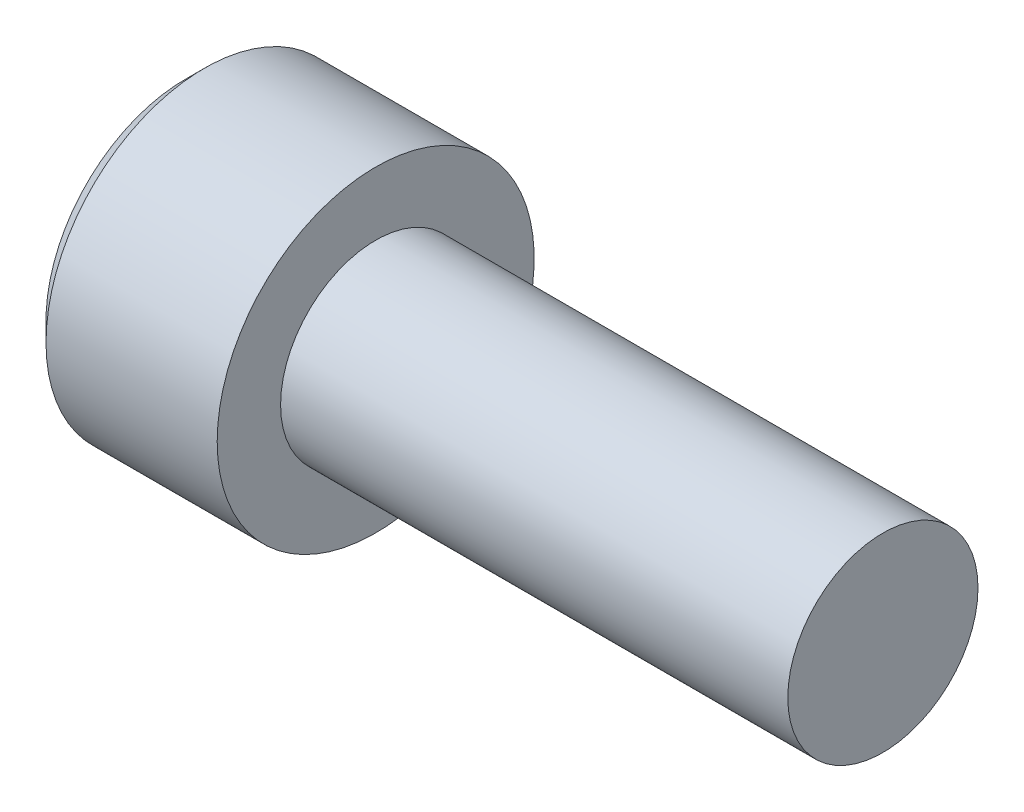
ISO-10303-21;
HEADER;
FILE_DESCRIPTION(('STEP AP214'),'2;1');
FILE_NAME('part.step','',(''),(''),'','','');
FILE_SCHEMA(('AUTOMOTIVE_DESIGN { 1 0 10303 214 1 1 1 1 }'));
ENDSEC;
DATA;
#1=APPLICATION_CONTEXT('core data for automotive mechanical design processes');
#2=APPLICATION_PROTOCOL_DEFINITION('international standard','automotive_design',2000,#1);
#3=PRODUCT_CONTEXT('',#1,'mechanical');
#4=PRODUCT('Part','Part','',(#3));
#5=PRODUCT_RELATED_PRODUCT_CATEGORY('part','',(#4));
#6=PRODUCT_DEFINITION_FORMATION('','',#4);
#7=PRODUCT_DEFINITION_CONTEXT('part definition',#1,'design');
#8=PRODUCT_DEFINITION('design','',#6,#7);
#9=PRODUCT_DEFINITION_SHAPE('','',#8);
#10=(LENGTH_UNIT() NAMED_UNIT(*) SI_UNIT(.MILLI.,.METRE.));
#11=(NAMED_UNIT(*) PLANE_ANGLE_UNIT() SI_UNIT($,.RADIAN.));
#12=(NAMED_UNIT(*) SI_UNIT($,.STERADIAN.) SOLID_ANGLE_UNIT());
#13=UNCERTAINTY_MEASURE_WITH_UNIT(LENGTH_MEASURE(1.E-05),#10,'distance_accuracy_value','');
#14=(GEOMETRIC_REPRESENTATION_CONTEXT(3) GLOBAL_UNCERTAINTY_ASSIGNED_CONTEXT((#13)) GLOBAL_UNIT_ASSIGNED_CONTEXT((#10,
#11,#12)) REPRESENTATION_CONTEXT('',''));
#15=CARTESIAN_POINT('',(0.,0.,0.));
#16=DIRECTION('',(0.,0.,1.));
#17=DIRECTION('',(1.,0.,0.));
#18=AXIS2_PLACEMENT_3D('',#15,#16,#17);
#19=CARTESIAN_POINT('',(-6.,0.,0.));
#20=DIRECTION('',(1.,0.,0.));
#21=DIRECTION('',(0.,0.,-1.));
#22=AXIS2_PLACEMENT_3D('',#19,#20,#21);
#23=PLANE('',#22);
#24=CARTESIAN_POINT('',(-6.,0.,0.));
#25=DIRECTION('',(1.,0.,0.));
#26=DIRECTION('',(0.,0.,-1.));
#27=AXIS2_PLACEMENT_3D('',#24,#25,#26);
#28=CIRCLE('',#27,4.4);
#29=CARTESIAN_POINT('',(-6.,0.,-4.4));
#30=VERTEX_POINT('',#29);
#31=EDGE_CURVE('E45',#30,#30,#28,.F.);
#32=ORIENTED_EDGE('',*,*,#31,.T.);
#33=EDGE_LOOP('',(#32));
#34=FACE_BOUND('',#33,.T.);
#35=DIRECTION('',(0.,0.5,-0.866025403784439));
#36=VECTOR('',#35,1.);
#37=CARTESIAN_POINT('',(-6.,1.44337567297406,2.5));
#38=LINE('',#37,#36);
#39=CARTESIAN_POINT('',(-6.,1.44337567297406,2.5));
#40=VERTEX_POINT('',#39);
#41=CARTESIAN_POINT('',(-6.,2.88675134594813,0.));
#42=VERTEX_POINT('',#41);
#43=EDGE_CURVE('E150',#40,#42,#38,.T.);
#44=ORIENTED_EDGE('',*,*,#43,.F.);
#45=DIRECTION('',(0.,1.,0.));
#46=VECTOR('',#45,1.);
#47=CARTESIAN_POINT('',(-6.,-1.44337567297407,2.5));
#48=LINE('',#47,#46);
#49=CARTESIAN_POINT('',(-6.,-1.44337567297407,2.5));
#50=VERTEX_POINT('',#49);
#51=EDGE_CURVE('E123',#50,#40,#48,.T.);
#52=ORIENTED_EDGE('',*,*,#51,.F.);
#53=DIRECTION('',(0.,0.5,0.866025403784439));
#54=VECTOR('',#53,1.);
#55=CARTESIAN_POINT('',(-6.,-2.88675134594813,0.));
#56=LINE('',#55,#54);
#57=CARTESIAN_POINT('',(-6.,-2.88675134594813,0.));
#58=VERTEX_POINT('',#57);
#59=EDGE_CURVE('E119',#58,#50,#56,.T.);
#60=ORIENTED_EDGE('',*,*,#59,.F.);
#61=DIRECTION('',(0.,-0.5,0.866025403784438));
#62=VECTOR('',#61,1.);
#63=CARTESIAN_POINT('',(-6.,-1.44337567297407,-2.5));
#64=LINE('',#63,#62);
#65=CARTESIAN_POINT('',(-6.,-1.44337567297407,-2.5));
#66=VERTEX_POINT('',#65);
#67=EDGE_CURVE('E156',#66,#58,#64,.T.);
#68=ORIENTED_EDGE('',*,*,#67,.F.);
#69=DIRECTION('',(0.,-1.,0.));
#70=VECTOR('',#69,1.);
#71=CARTESIAN_POINT('',(-6.,1.44337567297406,-2.5));
#72=LINE('',#71,#70);
#73=CARTESIAN_POINT('',(-6.,1.44337567297406,-2.5));
#74=VERTEX_POINT('',#73);
#75=EDGE_CURVE('E154',#74,#66,#72,.T.);
#76=ORIENTED_EDGE('',*,*,#75,.F.);
#77=DIRECTION('',(0.,-0.5,-0.866025403784439));
#78=VECTOR('',#77,1.);
#79=CARTESIAN_POINT('',(-6.,2.88675134594813,0.));
#80=LINE('',#79,#78);
#81=EDGE_CURVE('E152',#42,#74,#80,.T.);
#82=ORIENTED_EDGE('',*,*,#81,.F.);
#83=EDGE_LOOP('',(#44,#52,#60,#68,#76,#82));
#84=FACE_BOUND('',#83,.T.);
#85=ADVANCED_FACE('F37',(#34,#84),#23,.F.);
#86=CARTESIAN_POINT('',(0.,3.,0.));
#87=DIRECTION('',(-1.,0.,0.));
#88=DIRECTION('',(0.,0.,1.));
#89=AXIS2_PLACEMENT_3D('',#86,#87,#88);
#90=PLANE('',#89);
#91=CARTESIAN_POINT('',(0.,0.,0.));
#92=DIRECTION('',(-1.,0.,0.));
#93=DIRECTION('',(0.,0.,1.));
#94=AXIS2_PLACEMENT_3D('',#91,#92,#93);
#95=CIRCLE('',#94,5.);
#96=CARTESIAN_POINT('',(0.,0.,5.));
#97=VERTEX_POINT('',#96);
#98=EDGE_CURVE('E182',#97,#97,#95,.T.);
#99=ORIENTED_EDGE('',*,*,#98,.F.);
#100=EDGE_LOOP('',(#99));
#101=FACE_BOUND('',#100,.T.);
#102=CARTESIAN_POINT('',(0.,0.,0.));
#103=DIRECTION('',(-1.,0.,0.));
#104=DIRECTION('',(0.,0.,1.));
#105=AXIS2_PLACEMENT_3D('',#102,#103,#104);
#106=CIRCLE('',#105,3.);
#107=CARTESIAN_POINT('',(0.,0.,3.));
#108=VERTEX_POINT('',#107);
#109=EDGE_CURVE('E176',#108,#108,#106,.T.);
#110=ORIENTED_EDGE('',*,*,#109,.T.);
#111=EDGE_LOOP('',(#110));
#112=FACE_BOUND('',#111,.T.);
#113=ADVANCED_FACE('F200',(#101,#112),#90,.F.);
#114=CARTESIAN_POINT('',(-6.,0.,0.));
#115=DIRECTION('',(-1.,0.,0.));
#116=DIRECTION('',(0.,0.,1.));
#117=AXIS2_PLACEMENT_3D('',#114,#115,#116);
#118=CYLINDRICAL_SURFACE('',#117,5.);
#119=CARTESIAN_POINT('',(-5.4,0.,0.));
#120=DIRECTION('',(1.,0.,0.));
#121=DIRECTION('',(0.,0.,-1.));
#122=AXIS2_PLACEMENT_3D('',#119,#120,#121);
#123=CIRCLE('',#122,5.);
#124=CARTESIAN_POINT('',(-5.4,0.,-5.));
#125=VERTEX_POINT('',#124);
#126=EDGE_CURVE('E11',#125,#125,#123,.T.);
#127=ORIENTED_EDGE('',*,*,#126,.T.);
#128=EDGE_LOOP('',(#127));
#129=FACE_BOUND('',#128,.T.);
#130=ORIENTED_EDGE('',*,*,#98,.T.);
#131=EDGE_LOOP('',(#130));
#132=FACE_BOUND('',#131,.T.);
#133=ADVANCED_FACE('F205',(#129,#132),#118,.T.);
#134=CARTESIAN_POINT('',(16.,3.,0.));
#135=DIRECTION('',(-1.,0.,0.));
#136=DIRECTION('',(0.,0.,1.));
#137=AXIS2_PLACEMENT_3D('',#134,#135,#136);
#138=PLANE('',#137);
#139=CARTESIAN_POINT('',(16.,0.,0.));
#140=DIRECTION('',(-1.,0.,0.));
#141=DIRECTION('',(0.,0.,1.));
#142=AXIS2_PLACEMENT_3D('',#139,#140,#141);
#143=CIRCLE('',#142,3.);
#144=CARTESIAN_POINT('',(16.,0.,3.));
#145=VERTEX_POINT('',#144);
#146=EDGE_CURVE('E179',#145,#145,#143,.T.);
#147=ORIENTED_EDGE('',*,*,#146,.F.);
#148=EDGE_LOOP('',(#147));
#149=FACE_BOUND('',#148,.T.);
#150=ADVANCED_FACE('F209',(#149),#138,.F.);
#151=CARTESIAN_POINT('',(-6.,0.,0.));
#152=DIRECTION('',(-1.,0.,0.));
#153=DIRECTION('',(0.,0.,1.));
#154=AXIS2_PLACEMENT_3D('',#151,#152,#153);
#155=CYLINDRICAL_SURFACE('',#154,3.);
#156=ORIENTED_EDGE('',*,*,#109,.F.);
#157=EDGE_LOOP('',(#156));
#158=FACE_BOUND('',#157,.T.);
#159=ORIENTED_EDGE('',*,*,#146,.T.);
#160=EDGE_LOOP('',(#159));
#161=FACE_BOUND('',#160,.T.);
#162=ADVANCED_FACE('F216',(#158,#161),#155,.T.);
#163=CARTESIAN_POINT('',(-3.,-1.44337567297407,2.5));
#164=DIRECTION('',(0.,0.,1.));
#165=DIRECTION('',(1.,0.,0.));
#166=AXIS2_PLACEMENT_3D('',#163,#164,#165);
#167=PLANE('',#166);
#168=DIRECTION('',(0.,1.,0.));
#169=VECTOR('',#168,1.);
#170=CARTESIAN_POINT('',(-3.,-1.44337567297407,2.5));
#171=LINE('',#170,#169);
#172=CARTESIAN_POINT('',(-3.,-1.44337567297407,2.5));
#173=VERTEX_POINT('',#172);
#174=CARTESIAN_POINT('',(-3.,0.,2.5));
#175=VERTEX_POINT('',#174);
#176=EDGE_CURVE('E60',#173,#175,#171,.T.);
#177=ORIENTED_EDGE('',*,*,#176,.F.);
#178=DIRECTION('',(-1.,0.,0.));
#179=VECTOR('',#178,1.);
#180=CARTESIAN_POINT('',(-3.,-1.44337567297407,2.5));
#181=LINE('',#180,#179);
#182=EDGE_CURVE('E160',#173,#50,#181,.T.);
#183=ORIENTED_EDGE('',*,*,#182,.T.);
#184=ORIENTED_EDGE('',*,*,#51,.T.);
#185=DIRECTION('',(-1.,0.,0.));
#186=VECTOR('',#185,1.);
#187=CARTESIAN_POINT('',(-3.,1.44337567297406,2.5));
#188=LINE('',#187,#186);
#189=CARTESIAN_POINT('',(-3.,1.44337567297406,2.5));
#190=VERTEX_POINT('',#189);
#191=EDGE_CURVE('E52',#190,#40,#188,.T.);
#192=ORIENTED_EDGE('',*,*,#191,.F.);
#193=EDGE_CURVE('E112',#175,#190,#171,.T.);
#194=ORIENTED_EDGE('',*,*,#193,.F.);
#195=EDGE_LOOP('',(#177,#183,#184,#192,#194));
#196=FACE_BOUND('',#195,.T.);
#197=ADVANCED_FACE('F121',(#196),#167,.F.);
#198=CARTESIAN_POINT('',(-3.,-2.88675134594813,0.));
#199=DIRECTION('',(0.,-0.866025403784439,0.5));
#200=DIRECTION('',(0.,-0.5,-0.866025403784439));
#201=AXIS2_PLACEMENT_3D('',#198,#199,#200);
#202=PLANE('',#201);
#203=DIRECTION('',(0.,0.5,0.866025403784439));
#204=VECTOR('',#203,1.);
#205=CARTESIAN_POINT('',(-3.,-2.88675134594813,0.));
#206=LINE('',#205,#204);
#207=CARTESIAN_POINT('',(-3.,-2.88675134594813,0.));
#208=VERTEX_POINT('',#207);
#209=CARTESIAN_POINT('',(-3.,-2.1650635094611,1.25));
#210=VERTEX_POINT('',#209);
#211=EDGE_CURVE('E126',#208,#210,#206,.T.);
#212=ORIENTED_EDGE('',*,*,#211,.F.);
#213=DIRECTION('',(-1.,0.,0.));
#214=VECTOR('',#213,1.);
#215=CARTESIAN_POINT('',(-3.,-2.88675134594813,0.));
#216=LINE('',#215,#214);
#217=EDGE_CURVE('E163',#208,#58,#216,.T.);
#218=ORIENTED_EDGE('',*,*,#217,.T.);
#219=ORIENTED_EDGE('',*,*,#59,.T.);
#220=ORIENTED_EDGE('',*,*,#182,.F.);
#221=EDGE_CURVE('E146',#210,#173,#206,.T.);
#222=ORIENTED_EDGE('',*,*,#221,.F.);
#223=EDGE_LOOP('',(#212,#218,#219,#220,#222));
#224=FACE_BOUND('',#223,.T.);
#225=ADVANCED_FACE('F229',(#224),#202,.F.);
#226=CARTESIAN_POINT('',(-3.,-1.44337567297407,-2.5));
#227=DIRECTION('',(0.,-0.866025403784439,-0.5));
#228=DIRECTION('',(0.,0.5,-0.866025403784439));
#229=AXIS2_PLACEMENT_3D('',#226,#227,#228);
#230=PLANE('',#229);
#231=DIRECTION('',(0.,-0.5,0.866025403784438));
#232=VECTOR('',#231,1.);
#233=CARTESIAN_POINT('',(-3.,-1.44337567297407,-2.5));
#234=LINE('',#233,#232);
#235=CARTESIAN_POINT('',(-3.,-1.44337567297407,-2.5));
#236=VERTEX_POINT('',#235);
#237=CARTESIAN_POINT('',(-3.,-2.1650635094611,-1.25));
#238=VERTEX_POINT('',#237);
#239=EDGE_CURVE('E143',#236,#238,#234,.T.);
#240=ORIENTED_EDGE('',*,*,#239,.F.);
#241=DIRECTION('',(-1.,0.,0.));
#242=VECTOR('',#241,1.);
#243=CARTESIAN_POINT('',(-3.,-1.44337567297407,-2.5));
#244=LINE('',#243,#242);
#245=EDGE_CURVE('E166',#236,#66,#244,.T.);
#246=ORIENTED_EDGE('',*,*,#245,.T.);
#247=ORIENTED_EDGE('',*,*,#67,.T.);
#248=ORIENTED_EDGE('',*,*,#217,.F.);
#249=EDGE_CURVE('E142',#238,#208,#234,.T.);
#250=ORIENTED_EDGE('',*,*,#249,.F.);
#251=EDGE_LOOP('',(#240,#246,#247,#248,#250));
#252=FACE_BOUND('',#251,.T.);
#253=ADVANCED_FACE('F241',(#252),#230,.F.);
#254=CARTESIAN_POINT('',(-3.,1.44337567297406,-2.5));
#255=DIRECTION('',(0.,0.,-1.));
#256=DIRECTION('',(0.,1.,0.));
#257=AXIS2_PLACEMENT_3D('',#254,#255,#256);
#258=PLANE('',#257);
#259=DIRECTION('',(0.,-1.,0.));
#260=VECTOR('',#259,1.);
#261=CARTESIAN_POINT('',(-3.,1.44337567297406,-2.5));
#262=LINE('',#261,#260);
#263=CARTESIAN_POINT('',(-3.,1.44337567297406,-2.5));
#264=VERTEX_POINT('',#263);
#265=CARTESIAN_POINT('',(-3.,0.,-2.5));
#266=VERTEX_POINT('',#265);
#267=EDGE_CURVE('E139',#264,#266,#262,.T.);
#268=ORIENTED_EDGE('',*,*,#267,.F.);
#269=DIRECTION('',(-1.,0.,0.));
#270=VECTOR('',#269,1.);
#271=CARTESIAN_POINT('',(-3.,1.44337567297406,-2.5));
#272=LINE('',#271,#270);
#273=EDGE_CURVE('E169',#264,#74,#272,.T.);
#274=ORIENTED_EDGE('',*,*,#273,.T.);
#275=ORIENTED_EDGE('',*,*,#75,.T.);
#276=ORIENTED_EDGE('',*,*,#245,.F.);
#277=EDGE_CURVE('E138',#266,#236,#262,.T.);
#278=ORIENTED_EDGE('',*,*,#277,.F.);
#279=EDGE_LOOP('',(#268,#274,#275,#276,#278));
#280=FACE_BOUND('',#279,.T.);
#281=ADVANCED_FACE('F237',(#280),#258,.F.);
#282=CARTESIAN_POINT('',(-3.,2.88675134594813,0.));
#283=DIRECTION('',(0.,0.866025403784439,-0.5));
#284=DIRECTION('',(0.,0.5,0.866025403784439));
#285=AXIS2_PLACEMENT_3D('',#282,#283,#284);
#286=PLANE('',#285);
#287=DIRECTION('',(0.,-0.5,-0.866025403784439));
#288=VECTOR('',#287,1.);
#289=CARTESIAN_POINT('',(-3.,2.88675134594813,0.));
#290=LINE('',#289,#288);
#291=CARTESIAN_POINT('',(-3.,2.88675134594813,0.));
#292=VERTEX_POINT('',#291);
#293=CARTESIAN_POINT('',(-3.,2.1650635094611,-1.25));
#294=VERTEX_POINT('',#293);
#295=EDGE_CURVE('E134',#292,#294,#290,.T.);
#296=ORIENTED_EDGE('',*,*,#295,.F.);
#297=DIRECTION('',(-1.,0.,0.));
#298=VECTOR('',#297,1.);
#299=CARTESIAN_POINT('',(-3.,2.88675134594813,0.));
#300=LINE('',#299,#298);
#301=EDGE_CURVE('E125',#292,#42,#300,.T.);
#302=ORIENTED_EDGE('',*,*,#301,.T.);
#303=ORIENTED_EDGE('',*,*,#81,.T.);
#304=ORIENTED_EDGE('',*,*,#273,.F.);
#305=EDGE_CURVE('E132',#294,#264,#290,.T.);
#306=ORIENTED_EDGE('',*,*,#305,.F.);
#307=EDGE_LOOP('',(#296,#302,#303,#304,#306));
#308=FACE_BOUND('',#307,.T.);
#309=ADVANCED_FACE('F234',(#308),#286,.F.);
#310=CARTESIAN_POINT('',(-3.,1.44337567297406,2.5));
#311=DIRECTION('',(0.,0.866025403784438,0.5));
#312=DIRECTION('',(0.,-0.5,0.866025403784439));
#313=AXIS2_PLACEMENT_3D('',#310,#311,#312);
#314=PLANE('',#313);
#315=DIRECTION('',(0.,0.5,-0.866025403784439));
#316=VECTOR('',#315,1.);
#317=CARTESIAN_POINT('',(-3.,1.44337567297406,2.5));
#318=LINE('',#317,#316);
#319=CARTESIAN_POINT('',(-3.,2.1650635094611,1.25));
#320=VERTEX_POINT('',#319);
#321=EDGE_CURVE('E114',#190,#320,#318,.T.);
#322=ORIENTED_EDGE('',*,*,#321,.F.);
#323=ORIENTED_EDGE('',*,*,#191,.T.);
#324=ORIENTED_EDGE('',*,*,#43,.T.);
#325=ORIENTED_EDGE('',*,*,#301,.F.);
#326=EDGE_CURVE('E131',#320,#292,#318,.T.);
#327=ORIENTED_EDGE('',*,*,#326,.F.);
#328=EDGE_LOOP('',(#322,#323,#324,#325,#327));
#329=FACE_BOUND('',#328,.T.);
#330=ADVANCED_FACE('F129',(#329),#314,.F.);
#331=CARTESIAN_POINT('',(-3.,0.,0.));
#332=DIRECTION('',(-1.,0.,0.));
#333=DIRECTION('',(0.,0.,1.));
#334=AXIS2_PLACEMENT_3D('',#331,#332,#333);
#335=PLANE('',#334);
#336=ORIENTED_EDGE('',*,*,#193,.T.);
#337=ORIENTED_EDGE('',*,*,#321,.T.);
#338=CARTESIAN_POINT('',(-3.,0.,0.));
#339=DIRECTION('',(-1.,0.,0.));
#340=DIRECTION('',(0.,-1.,0.));
#341=AXIS2_PLACEMENT_3D('',#338,#339,#340);
#342=CIRCLE('',#341,2.5);
#343=EDGE_CURVE('E116',#175,#320,#342,.T.);
#344=ORIENTED_EDGE('',*,*,#343,.F.);
#345=EDGE_LOOP('',(#336,#337,#344));
#346=FACE_BOUND('',#345,.T.);
#347=ADVANCED_FACE('F113',(#346),#335,.T.);
#348=ORIENTED_EDGE('',*,*,#326,.T.);
#349=ORIENTED_EDGE('',*,*,#295,.T.);
#350=EDGE_CURVE('E269',#320,#294,#342,.T.);
#351=ORIENTED_EDGE('',*,*,#350,.F.);
#352=EDGE_LOOP('',(#348,#349,#351));
#353=FACE_BOUND('',#352,.T.);
#354=ADVANCED_FACE('F257',(#353),#335,.T.);
#355=ORIENTED_EDGE('',*,*,#305,.T.);
#356=ORIENTED_EDGE('',*,*,#267,.T.);
#357=EDGE_CURVE('E275',#294,#266,#342,.T.);
#358=ORIENTED_EDGE('',*,*,#357,.F.);
#359=EDGE_LOOP('',(#355,#356,#358));
#360=FACE_BOUND('',#359,.T.);
#361=ADVANCED_FACE('F261',(#360),#335,.T.);
#362=ORIENTED_EDGE('',*,*,#277,.T.);
#363=ORIENTED_EDGE('',*,*,#239,.T.);
#364=EDGE_CURVE('E277',#266,#238,#342,.T.);
#365=ORIENTED_EDGE('',*,*,#364,.F.);
#366=EDGE_LOOP('',(#362,#363,#365));
#367=FACE_BOUND('',#366,.T.);
#368=ADVANCED_FACE('F254',(#367),#335,.T.);
#369=ORIENTED_EDGE('',*,*,#249,.T.);
#370=ORIENTED_EDGE('',*,*,#211,.T.);
#371=EDGE_CURVE('E162',#238,#210,#342,.T.);
#372=ORIENTED_EDGE('',*,*,#371,.F.);
#373=EDGE_LOOP('',(#369,#370,#372));
#374=FACE_BOUND('',#373,.T.);
#375=ADVANCED_FACE('F250',(#374),#335,.T.);
#376=ORIENTED_EDGE('',*,*,#221,.T.);
#377=ORIENTED_EDGE('',*,*,#176,.T.);
#378=EDGE_CURVE('E174',#210,#175,#342,.T.);
#379=ORIENTED_EDGE('',*,*,#378,.F.);
#380=EDGE_LOOP('',(#376,#377,#379));
#381=FACE_BOUND('',#380,.T.);
#382=ADVANCED_FACE('F195',(#381),#335,.T.);
#383=CARTESIAN_POINT('',(-1.49784845243108,0.,0.));
#384=DIRECTION('',(-1.,0.,0.));
#385=DIRECTION('',(0.,-1.,0.));
#386=AXIS2_PLACEMENT_3D('',#383,#384,#385);
#387=CONICAL_SURFACE('',#386,0.,1.02974425867665);
#388=ORIENTED_EDGE('',*,*,#378,.T.);
#389=ORIENTED_EDGE('',*,*,#343,.T.);
#390=ORIENTED_EDGE('',*,*,#350,.T.);
#391=ORIENTED_EDGE('',*,*,#357,.T.);
#392=ORIENTED_EDGE('',*,*,#364,.T.);
#393=ORIENTED_EDGE('',*,*,#371,.T.);
#394=EDGE_LOOP('',(#388,#389,#390,#391,#392,#393));
#395=FACE_BOUND('',#394,.T.);
#396=CARTESIAN_POINT('',(-1.49784845243108,0.,0.));
#397=VERTEX_POINT('',#396);
#398=VERTEX_LOOP('',#397);
#399=FACE_BOUND('',#398,.T.);
#400=ADVANCED_FACE('F190',(#395,#399),#387,.F.);
#401=CARTESIAN_POINT('',(-6.,0.,0.));
#402=DIRECTION('',(1.,0.,0.));
#403=DIRECTION('',(0.,0.,-1.));
#404=AXIS2_PLACEMENT_3D('',#401,#402,#403);
#405=CONICAL_SURFACE('',#404,4.4,0.785398163397448);
#406=ORIENTED_EDGE('',*,*,#126,.F.);
#407=EDGE_LOOP('',(#406));
#408=FACE_BOUND('',#407,.T.);
#409=ORIENTED_EDGE('',*,*,#31,.F.);
#410=EDGE_LOOP('',(#409));
#411=FACE_BOUND('',#410,.T.);
#412=ADVANCED_FACE('F39',(#408,#411),#405,.T.);
#413=CLOSED_SHELL('',(#85,#113,#133,#150,#162,#197,#225,#253,#281,#309,#330,#347,#354,#361,#368,
#375,#382,#400,#412));
#414=MANIFOLD_SOLID_BREP('B2',#413);
#415=ADVANCED_BREP_SHAPE_REPRESENTATION('',(#18,#414),#14);
#416=SHAPE_DEFINITION_REPRESENTATION(#9,#415);
ENDSEC;
END-ISO-10303-21;
